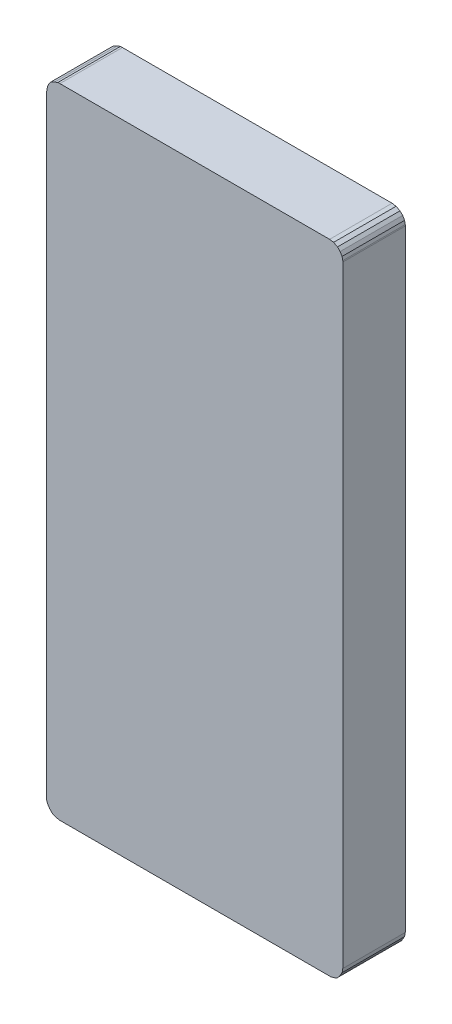
ISO-10303-21;
HEADER;
FILE_DESCRIPTION(('STEP AP214'),'2;1');
FILE_NAME('part.step','',(''),(''),'','','');
FILE_SCHEMA(('AUTOMOTIVE_DESIGN { 1 0 10303 214 1 1 1 1 }'));
ENDSEC;
DATA;
#1=APPLICATION_CONTEXT('core data for automotive mechanical design processes');
#2=APPLICATION_PROTOCOL_DEFINITION('international standard','automotive_design',2000,#1);
#3=PRODUCT_CONTEXT('',#1,'mechanical');
#4=PRODUCT('Part','Part','',(#3));
#5=PRODUCT_RELATED_PRODUCT_CATEGORY('part','',(#4));
#6=PRODUCT_DEFINITION_FORMATION('','',#4);
#7=PRODUCT_DEFINITION_CONTEXT('part definition',#1,'design');
#8=PRODUCT_DEFINITION('design','',#6,#7);
#9=PRODUCT_DEFINITION_SHAPE('','',#8);
#10=(LENGTH_UNIT() NAMED_UNIT(*) SI_UNIT(.MILLI.,.METRE.));
#11=(NAMED_UNIT(*) PLANE_ANGLE_UNIT() SI_UNIT($,.RADIAN.));
#12=(NAMED_UNIT(*) SI_UNIT($,.STERADIAN.) SOLID_ANGLE_UNIT());
#13=UNCERTAINTY_MEASURE_WITH_UNIT(LENGTH_MEASURE(1.E-05),#10,'distance_accuracy_value','');
#14=(GEOMETRIC_REPRESENTATION_CONTEXT(3) GLOBAL_UNCERTAINTY_ASSIGNED_CONTEXT((#13)) GLOBAL_UNIT_ASSIGNED_CONTEXT((#10,
#11,#12)) REPRESENTATION_CONTEXT('',''));
#15=CARTESIAN_POINT('',(0.,0.,0.));
#16=DIRECTION('',(0.,0.,1.));
#17=DIRECTION('',(1.,0.,0.));
#18=AXIS2_PLACEMENT_3D('',#15,#16,#17);
#19=CARTESIAN_POINT('',(-2.0499959,4.84999792,0.95));
#20=DIRECTION('',(0.,0.,1.));
#21=DIRECTION('',(1.,0.,0.));
#22=AXIS2_PLACEMENT_3D('',#19,#20,#21);
#23=PLANE('',#22);
#24=DIRECTION('',(-0.986433398876365,0.164161961432061,0.));
#25=VECTOR('',#24,1.);
#26=CARTESIAN_POINT('',(2.05000606,4.84998776,0.95));
#27=LINE('',#26,#25);
#28=CARTESIAN_POINT('',(2.05000606,4.84998776,0.95));
#29=VERTEX_POINT('',#28);
#30=CARTESIAN_POINT('',(2.1100034,4.84000302,0.95));
#31=VERTEX_POINT('',#30);
#32=EDGE_CURVE('E508',#29,#31,#27,.F.);
#33=ORIENTED_EDGE('',*,*,#32,.F.);
#34=DIRECTION('',(-0.99999999999693,2.47804759638983E-06,0.));
#35=VECTOR('',#34,1.);
#36=CARTESIAN_POINT('',(-2.0499959,4.84999792,0.95));
#37=LINE('',#36,#35);
#38=CARTESIAN_POINT('',(-2.04999590002709,4.84999792,0.95));
#39=VERTEX_POINT('',#38);
#40=EDGE_CURVE('E217',#39,#29,#37,.F.);
#41=ORIENTED_EDGE('',*,*,#40,.F.);
#42=DIRECTION('',(-0.999999985663054,0.000169333669372809,0.));
#43=VECTOR('',#42,1.);
#44=CARTESIAN_POINT('',(-2.07999584,4.850003,0.95));
#45=LINE('',#44,#43);
#46=CARTESIAN_POINT('',(-2.07999584,4.850003,0.95));
#47=VERTEX_POINT('',#46);
#48=EDGE_CURVE('E19',#47,#39,#45,.F.);
#49=ORIENTED_EDGE('',*,*,#48,.F.);
#50=DIRECTION('',(-0.928476690885259,-0.371390676354104,0.));
#51=VECTOR('',#50,1.);
#52=CARTESIAN_POINT('',(-2.12999574,4.83000304,0.95));
#53=LINE('',#52,#51);
#54=CARTESIAN_POINT('',(-2.12999574,4.83000304,0.95));
#55=VERTEX_POINT('',#54);
#56=EDGE_CURVE('E203',#55,#47,#53,.F.);
#57=ORIENTED_EDGE('',*,*,#56,.F.);
#58=DIRECTION('',(-0.894427190999916,-0.447213595499958,0.));
#59=VECTOR('',#58,1.);
#60=CARTESIAN_POINT('',(-2.18999562,4.8000031,0.95));
#61=LINE('',#60,#59);
#62=CARTESIAN_POINT('',(-2.18999562,4.8000031,0.95));
#63=VERTEX_POINT('',#62);
#64=EDGE_CURVE('E224',#63,#55,#61,.F.);
#65=ORIENTED_EDGE('',*,*,#64,.F.);
#66=DIRECTION('',(-0.6,-0.8,0.));
#67=VECTOR('',#66,1.);
#68=CARTESIAN_POINT('',(-2.21999556,4.76000318,0.95));
#69=LINE('',#68,#67);
#70=CARTESIAN_POINT('',(-2.21999556,4.76000318,0.95));
#71=VERTEX_POINT('',#70);
#72=EDGE_CURVE('E306',#71,#63,#69,.F.);
#73=ORIENTED_EDGE('',*,*,#72,.F.);
#74=DIRECTION('',(-0.371390676354104,-0.928476690885259,0.));
#75=VECTOR('',#74,1.);
#76=CARTESIAN_POINT('',(-2.23999552,4.71000328,0.95));
#77=LINE('',#76,#75);
#78=CARTESIAN_POINT('',(-2.23999552,4.71000328,0.95));
#79=VERTEX_POINT('',#78);
#80=EDGE_CURVE('E301',#79,#71,#77,.F.);
#81=ORIENTED_EDGE('',*,*,#80,.F.);
#82=DIRECTION('',(-0.164480243326035,-0.986380377722209,0.));
#83=VECTOR('',#82,1.);
#84=CARTESIAN_POINT('',(-2.25000058,4.6500034,0.95));
#85=LINE('',#84,#83);
#86=CARTESIAN_POINT('',(-2.25000058,4.6500034,0.95));
#87=VERTEX_POINT('',#86);
#88=EDGE_CURVE('E296',#87,#79,#85,.F.);
#89=ORIENTED_EDGE('',*,*,#88,.F.);
#90=DIRECTION('',(0.,1.,0.));
#91=VECTOR('',#90,1.);
#92=CARTESIAN_POINT('',(-2.25000058,-4.64999832,0.95));
#93=LINE('',#92,#91);
#94=CARTESIAN_POINT('',(-2.25000058,-4.64999832007946,0.950000000000001));
#95=VERTEX_POINT('',#94);
#96=EDGE_CURVE('E290',#95,#87,#93,.T.);
#97=ORIENTED_EDGE('',*,*,#96,.F.);
#98=DIRECTION('',(0.000127008318225856,-0.999999991934444,0.));
#99=VECTOR('',#98,1.);
#100=CARTESIAN_POINT('',(-2.2499955,-4.6899957,0.950000000000001));
#101=LINE('',#100,#99);
#102=CARTESIAN_POINT('',(-2.2499955,-4.6899957,0.95));
#103=VERTEX_POINT('',#102);
#104=EDGE_CURVE('E325',#103,#95,#101,.F.);
#105=ORIENTED_EDGE('',*,*,#104,.F.);
#106=DIRECTION('',(0.371390676354104,-0.928476690885259,0.));
#107=VECTOR('',#106,1.);
#108=CARTESIAN_POINT('',(-2.22999554,-4.7399956,0.95));
#109=LINE('',#108,#107);
#110=CARTESIAN_POINT('',(-2.22999554,-4.7399956,0.95));
#111=VERTEX_POINT('',#110);
#112=EDGE_CURVE('E285',#111,#103,#109,.F.);
#113=ORIENTED_EDGE('',*,*,#112,.F.);
#114=DIRECTION('',(0.6,-0.8,0.));
#115=VECTOR('',#114,1.);
#116=CARTESIAN_POINT('',(-2.1999956,-4.77999552,0.95));
#117=LINE('',#116,#115);
#118=CARTESIAN_POINT('',(-2.1999956,-4.77999552,0.95));
#119=VERTEX_POINT('',#118);
#120=EDGE_CURVE('E280',#119,#111,#117,.F.);
#121=ORIENTED_EDGE('',*,*,#120,.F.);
#122=DIRECTION('',(0.707106781186548,-0.707106781186548,0.));
#123=VECTOR('',#122,1.);
#124=CARTESIAN_POINT('',(-2.15999568,-4.81999544,0.95));
#125=LINE('',#124,#123);
#126=CARTESIAN_POINT('',(-2.15999568,-4.81999544,0.95));
#127=VERTEX_POINT('',#126);
#128=EDGE_CURVE('E275',#127,#119,#125,.F.);
#129=ORIENTED_EDGE('',*,*,#128,.F.);
#130=DIRECTION('',(0.928476690885259,-0.371390676354104,0.));
#131=VECTOR('',#130,1.);
#132=CARTESIAN_POINT('',(-2.10999578,-4.8399954,0.95));
#133=LINE('',#132,#131);
#134=CARTESIAN_POINT('',(-2.10999578,-4.83999540000001,0.95));
#135=VERTEX_POINT('',#134);
#136=EDGE_CURVE('E270',#135,#127,#133,.F.);
#137=ORIENTED_EDGE('',*,*,#136,.F.);
#138=DIRECTION('',(0.98639618128479,-0.164385442015965,0.));
#139=VECTOR('',#138,1.);
#140=CARTESIAN_POINT('',(-2.05000606,-4.84999284,0.95));
#141=LINE('',#140,#139);
#142=CARTESIAN_POINT('',(-2.05000606,-4.84999284,0.95));
#143=VERTEX_POINT('',#142);
#144=EDGE_CURVE('E265',#143,#135,#141,.F.);
#145=ORIENTED_EDGE('',*,*,#144,.F.);
#146=DIRECTION('',(0.99999999999693,-2.47804759638983E-06,0.));
#147=VECTOR('',#146,1.);
#148=CARTESIAN_POINT('',(2.0499959,-4.850003,0.95));
#149=LINE('',#148,#147);
#150=CARTESIAN_POINT('',(2.0499959,-4.850003,0.95));
#151=VERTEX_POINT('',#150);
#152=EDGE_CURVE('E260',#151,#143,#149,.F.);
#153=ORIENTED_EDGE('',*,*,#152,.F.);
#154=DIRECTION('',(0.999999927474493,0.000380855628345288,0.));
#155=VECTOR('',#154,1.);
#156=CARTESIAN_POINT('',(2.07000348,-4.84999538,0.95));
#157=LINE('',#156,#155);
#158=CARTESIAN_POINT('',(2.07000348,-4.84999537999999,0.95));
#159=VERTEX_POINT('',#158);
#160=EDGE_CURVE('E255',#159,#151,#157,.F.);
#161=ORIENTED_EDGE('',*,*,#160,.F.);
#162=DIRECTION('',(0.970142500145391,0.242535625036098,0.));
#163=VECTOR('',#162,1.);
#164=CARTESIAN_POINT('',(2.1100034,-4.8399954,0.95));
#165=LINE('',#164,#163);
#166=CARTESIAN_POINT('',(2.1100034,-4.8399954,0.95));
#167=VERTEX_POINT('',#166);
#168=EDGE_CURVE('E235',#167,#159,#165,.F.);
#169=ORIENTED_EDGE('',*,*,#168,.F.);
#170=DIRECTION('',(0.928476690885259,0.371390676354104,0.));
#171=VECTOR('',#170,1.);
#172=CARTESIAN_POINT('',(2.1600033,-4.81999544,0.95));
#173=LINE('',#172,#171);
#174=CARTESIAN_POINT('',(2.1600033,-4.81999544,0.95));
#175=VERTEX_POINT('',#174);
#176=EDGE_CURVE('E241',#175,#167,#173,.F.);
#177=ORIENTED_EDGE('',*,*,#176,.F.);
#178=DIRECTION('',(0.707106781186048,0.707106781187048,0.));
#179=VECTOR('',#178,1.);
#180=CARTESIAN_POINT('',(2.19000324,-4.7899955,0.95));
#181=LINE('',#180,#179);
#182=CARTESIAN_POINT('',(2.19000324,-4.7899955,0.95));
#183=VERTEX_POINT('',#182);
#184=EDGE_CURVE('E246',#183,#175,#181,.F.);
#185=ORIENTED_EDGE('',*,*,#184,.F.);
#186=DIRECTION('',(0.554700196224998,0.832050294337997,0.));
#187=VECTOR('',#186,1.);
#188=CARTESIAN_POINT('',(2.2100032,-4.75999556,0.95));
#189=LINE('',#188,#187);
#190=CARTESIAN_POINT('',(2.21000320000001,-4.75999556,0.95));
#191=VERTEX_POINT('',#190);
#192=EDGE_CURVE('E252',#191,#183,#189,.F.);
#193=ORIENTED_EDGE('',*,*,#192,.F.);
#194=DIRECTION('',(0.514495755426938,0.857492925712897,0.));
#195=VECTOR('',#194,1.);
#196=CARTESIAN_POINT('',(2.24000314,-4.70999566,0.95));
#197=LINE('',#196,#195);
#198=CARTESIAN_POINT('',(2.24000314,-4.70999566,0.95));
#199=VERTEX_POINT('',#198);
#200=EDGE_CURVE('E476',#199,#191,#197,.F.);
#201=ORIENTED_EDGE('',*,*,#200,.F.);
#202=DIRECTION('',(0.164229657338,0.986422130556002,0.));
#203=VECTOR('',#202,1.);
#204=CARTESIAN_POINT('',(2.24999042,-4.65000848,0.95));
#205=LINE('',#204,#203);
#206=CARTESIAN_POINT('',(2.24999042,-4.65000848,0.95));
#207=VERTEX_POINT('',#206);
#208=EDGE_CURVE('E480',#207,#199,#205,.F.);
#209=ORIENTED_EDGE('',*,*,#208,.F.);
#210=DIRECTION('',(1.09247291646744E-06,0.999999999999403,0.));
#211=VECTOR('',#210,1.);
#212=CARTESIAN_POINT('',(2.25000058,4.64999324,0.95));
#213=LINE('',#212,#211);
#214=CARTESIAN_POINT('',(2.25000058,4.64999324,0.95));
#215=VERTEX_POINT('',#214);
#216=EDGE_CURVE('E484',#215,#207,#213,.F.);
#217=ORIENTED_EDGE('',*,*,#216,.F.);
#218=DIRECTION('',(0.000126935769327356,0.999999991943655,0.));
#219=VECTOR('',#218,1.);
#220=CARTESIAN_POINT('',(2.25000312,4.67000336,0.95));
#221=LINE('',#220,#219);
#222=CARTESIAN_POINT('',(2.25000312,4.67000336,0.95));
#223=VERTEX_POINT('',#222);
#224=EDGE_CURVE('E488',#223,#215,#221,.F.);
#225=ORIENTED_EDGE('',*,*,#224,.F.);
#226=DIRECTION('',(-0.196116135137992,0.980580675690959,0.));
#227=VECTOR('',#226,1.);
#228=CARTESIAN_POINT('',(2.24000314,4.72000326,0.95));
#229=LINE('',#228,#227);
#230=CARTESIAN_POINT('',(2.24000313999999,4.72000326,0.95));
#231=VERTEX_POINT('',#230);
#232=EDGE_CURVE('E492',#231,#223,#229,.F.);
#233=ORIENTED_EDGE('',*,*,#232,.F.);
#234=DIRECTION('',(-0.514495755426938,0.857492925712897,0.));
#235=VECTOR('',#234,1.);
#236=CARTESIAN_POINT('',(2.2100032,4.77000316,0.95));
#237=LINE('',#236,#235);
#238=CARTESIAN_POINT('',(2.2100032,4.77000316,0.95));
#239=VERTEX_POINT('',#238);
#240=EDGE_CURVE('E496',#239,#231,#237,.F.);
#241=ORIENTED_EDGE('',*,*,#240,.F.);
#242=DIRECTION('',(-0.707106781186548,0.707106781186548,0.));
#243=VECTOR('',#242,1.);
#244=CARTESIAN_POINT('',(2.17000328,4.81000308,0.95));
#245=LINE('',#244,#243);
#246=CARTESIAN_POINT('',(2.17000328,4.81000308,0.95));
#247=VERTEX_POINT('',#246);
#248=EDGE_CURVE('E500',#247,#239,#245,.F.);
#249=ORIENTED_EDGE('',*,*,#248,.F.);
#250=DIRECTION('',(-0.894427190999916,0.447213595499958,0.));
#251=VECTOR('',#250,1.);
#252=CARTESIAN_POINT('',(2.1100034,4.84000302,0.95));
#253=LINE('',#252,#251);
#254=EDGE_CURVE('E504',#31,#247,#253,.F.);
#255=ORIENTED_EDGE('',*,*,#254,.F.);
#256=EDGE_LOOP('',(#33,#41,#49,#57,#65,#73,#81,#89,#97,#105,#113,#121,#129,#137,#145,#153,#161,
#169,#177,#185,#193,#201,#209,#217,#225,#233,#241,#249,#255));
#257=FACE_BOUND('',#256,.T.);
#258=ADVANCED_FACE('F16',(#257),#23,.T.);
#259=CARTESIAN_POINT('',(-2.07999584,4.850003,0.));
#260=DIRECTION('',(0.000169333669372809,0.999999985663054,0.));
#261=DIRECTION('',(-0.999999985663054,0.000169333669372809,0.));
#262=AXIS2_PLACEMENT_3D('',#259,#260,#261);
#263=PLANE('',#262);
#264=DIRECTION('',(0.,0.,1.));
#265=VECTOR('',#264,1.);
#266=CARTESIAN_POINT('',(-2.0499959,4.84999792,0.));
#267=LINE('',#266,#265);
#268=CARTESIAN_POINT('',(-2.04999588049491,4.84999791999833,0.));
#269=VERTEX_POINT('',#268);
#270=EDGE_CURVE('E231',#269,#39,#267,.T.);
#271=ORIENTED_EDGE('',*,*,#270,.F.);
#272=DIRECTION('',(-0.999999985663054,0.000169333669372809,0.));
#273=VECTOR('',#272,1.);
#274=CARTESIAN_POINT('',(-2.07999584,4.850003,0.));
#275=LINE('',#274,#273);
#276=CARTESIAN_POINT('',(-2.07999584,4.850003,0.));
#277=VERTEX_POINT('',#276);
#278=EDGE_CURVE('E223',#269,#277,#275,.T.);
#279=ORIENTED_EDGE('',*,*,#278,.T.);
#280=DIRECTION('',(0.,0.,1.));
#281=VECTOR('',#280,1.);
#282=CARTESIAN_POINT('',(-2.07999584,4.850003,0.));
#283=LINE('',#282,#281);
#284=EDGE_CURVE('E208',#47,#277,#283,.F.);
#285=ORIENTED_EDGE('',*,*,#284,.F.);
#286=ORIENTED_EDGE('',*,*,#48,.T.);
#287=EDGE_LOOP('',(#271,#279,#285,#286));
#288=FACE_BOUND('',#287,.T.);
#289=ADVANCED_FACE('F222',(#288),#263,.T.);
#290=CARTESIAN_POINT('',(-2.12999574,4.83000304,0.));
#291=DIRECTION('',(-0.371390676354104,0.928476690885259,0.));
#292=DIRECTION('',(-0.928476690885259,-0.371390676354104,0.));
#293=AXIS2_PLACEMENT_3D('',#290,#291,#292);
#294=PLANE('',#293);
#295=ORIENTED_EDGE('',*,*,#284,.T.);
#296=DIRECTION('',(-0.928476690885258,-0.371390676354106,0.));
#297=VECTOR('',#296,1.);
#298=CARTESIAN_POINT('',(-2.07999584,4.850003,0.));
#299=LINE('',#298,#297);
#300=CARTESIAN_POINT('',(-2.12999574,4.83000304,0.));
#301=VERTEX_POINT('',#300);
#302=EDGE_CURVE('E324',#277,#301,#299,.T.);
#303=ORIENTED_EDGE('',*,*,#302,.T.);
#304=DIRECTION('',(0.,0.,1.));
#305=VECTOR('',#304,1.);
#306=CARTESIAN_POINT('',(-2.12999574,4.83000304,0.));
#307=LINE('',#306,#305);
#308=EDGE_CURVE('E210',#55,#301,#307,.F.);
#309=ORIENTED_EDGE('',*,*,#308,.F.);
#310=ORIENTED_EDGE('',*,*,#56,.T.);
#311=EDGE_LOOP('',(#295,#303,#309,#310));
#312=FACE_BOUND('',#311,.T.);
#313=ADVANCED_FACE('F205',(#312),#294,.T.);
#314=CARTESIAN_POINT('',(-2.18999562,4.8000031,0.));
#315=DIRECTION('',(-0.447213595499958,0.894427190999916,0.));
#316=DIRECTION('',(-0.894427190999916,-0.447213595499958,0.));
#317=AXIS2_PLACEMENT_3D('',#314,#315,#316);
#318=PLANE('',#317);
#319=ORIENTED_EDGE('',*,*,#308,.T.);
#320=DIRECTION('',(-0.894427190999911,-0.447213595499968,0.));
#321=VECTOR('',#320,1.);
#322=CARTESIAN_POINT('',(-2.12999574,4.83000304,0.));
#323=LINE('',#322,#321);
#324=CARTESIAN_POINT('',(-2.18999562,4.8000031,0.));
#325=VERTEX_POINT('',#324);
#326=EDGE_CURVE('E359',#301,#325,#323,.T.);
#327=ORIENTED_EDGE('',*,*,#326,.T.);
#328=DIRECTION('',(0.,0.,1.));
#329=VECTOR('',#328,1.);
#330=CARTESIAN_POINT('',(-2.18999562,4.8000031,0.));
#331=LINE('',#330,#329);
#332=EDGE_CURVE('E303',#63,#325,#331,.F.);
#333=ORIENTED_EDGE('',*,*,#332,.F.);
#334=ORIENTED_EDGE('',*,*,#64,.T.);
#335=EDGE_LOOP('',(#319,#327,#333,#334));
#336=FACE_BOUND('',#335,.T.);
#337=ADVANCED_FACE('F379',(#336),#318,.T.);
#338=CARTESIAN_POINT('',(-2.21999556,4.76000318,0.));
#339=DIRECTION('',(-0.8,0.6,0.));
#340=DIRECTION('',(-0.6,-0.8,0.));
#341=AXIS2_PLACEMENT_3D('',#338,#339,#340);
#342=PLANE('',#341);
#343=ORIENTED_EDGE('',*,*,#332,.T.);
#344=DIRECTION('',(-0.600000000000008,-0.799999999999994,0.));
#345=VECTOR('',#344,1.);
#346=CARTESIAN_POINT('',(-2.18999562,4.8000031,0.));
#347=LINE('',#346,#345);
#348=CARTESIAN_POINT('',(-2.21999556,4.76000318,0.));
#349=VERTEX_POINT('',#348);
#350=EDGE_CURVE('E351',#325,#349,#347,.T.);
#351=ORIENTED_EDGE('',*,*,#350,.T.);
#352=DIRECTION('',(0.,0.,1.));
#353=VECTOR('',#352,1.);
#354=CARTESIAN_POINT('',(-2.21999556,4.76000318,0.));
#355=LINE('',#354,#353);
#356=EDGE_CURVE('E298',#71,#349,#355,.F.);
#357=ORIENTED_EDGE('',*,*,#356,.F.);
#358=ORIENTED_EDGE('',*,*,#72,.T.);
#359=EDGE_LOOP('',(#343,#351,#357,#358));
#360=FACE_BOUND('',#359,.T.);
#361=ADVANCED_FACE('F386',(#360),#342,.T.);
#362=CARTESIAN_POINT('',(-2.23999552,4.71000328,0.));
#363=DIRECTION('',(-0.928476690885259,0.371390676354104,0.));
#364=DIRECTION('',(-0.371390676354104,-0.928476690885259,0.));
#365=AXIS2_PLACEMENT_3D('',#362,#363,#364);
#366=PLANE('',#365);
#367=ORIENTED_EDGE('',*,*,#356,.T.);
#368=DIRECTION('',(-0.3713906763541,-0.928476690885261,0.));
#369=VECTOR('',#368,1.);
#370=CARTESIAN_POINT('',(-2.21999556,4.76000318,0.));
#371=LINE('',#370,#369);
#372=CARTESIAN_POINT('',(-2.23999552,4.71000328,0.));
#373=VERTEX_POINT('',#372);
#374=EDGE_CURVE('E343',#349,#373,#371,.T.);
#375=ORIENTED_EDGE('',*,*,#374,.T.);
#376=DIRECTION('',(0.,0.,1.));
#377=VECTOR('',#376,1.);
#378=CARTESIAN_POINT('',(-2.23999552,4.71000328,0.));
#379=LINE('',#378,#377);
#380=EDGE_CURVE('E293',#79,#373,#379,.F.);
#381=ORIENTED_EDGE('',*,*,#380,.F.);
#382=ORIENTED_EDGE('',*,*,#80,.T.);
#383=EDGE_LOOP('',(#367,#375,#381,#382));
#384=FACE_BOUND('',#383,.T.);
#385=ADVANCED_FACE('F388',(#384),#366,.T.);
#386=CARTESIAN_POINT('',(-2.25000058,4.6500034,0.));
#387=DIRECTION('',(-0.986380377722209,0.164480243326035,0.));
#388=DIRECTION('',(-0.164480243326035,-0.986380377722209,0.));
#389=AXIS2_PLACEMENT_3D('',#386,#387,#388);
#390=PLANE('',#389);
#391=ORIENTED_EDGE('',*,*,#380,.T.);
#392=DIRECTION('',(-0.164480243326046,-0.986380377722207,0.));
#393=VECTOR('',#392,1.);
#394=CARTESIAN_POINT('',(-2.23999552,4.71000328,0.));
#395=LINE('',#394,#393);
#396=CARTESIAN_POINT('',(-2.25000058,4.6500034,0.));
#397=VERTEX_POINT('',#396);
#398=EDGE_CURVE('E340',#373,#397,#395,.T.);
#399=ORIENTED_EDGE('',*,*,#398,.T.);
#400=DIRECTION('',(0.,0.,1.));
#401=VECTOR('',#400,1.);
#402=CARTESIAN_POINT('',(-2.25000058,4.6500034,0.));
#403=LINE('',#402,#401);
#404=EDGE_CURVE('E292',#87,#397,#403,.F.);
#405=ORIENTED_EDGE('',*,*,#404,.F.);
#406=ORIENTED_EDGE('',*,*,#88,.T.);
#407=EDGE_LOOP('',(#391,#399,#405,#406));
#408=FACE_BOUND('',#407,.T.);
#409=ADVANCED_FACE('F392',(#408),#390,.T.);
#410=CARTESIAN_POINT('',(-2.25000058,-4.64999832,0.));
#411=DIRECTION('',(-1.,0.,0.));
#412=DIRECTION('',(0.,0.,1.));
#413=AXIS2_PLACEMENT_3D('',#410,#411,#412);
#414=PLANE('',#413);
#415=ORIENTED_EDGE('',*,*,#404,.T.);
#416=DIRECTION('',(0.,1.,0.));
#417=VECTOR('',#416,1.);
#418=CARTESIAN_POINT('',(-2.25000058,4.84999792,0.));
#419=LINE('',#418,#417);
#420=CARTESIAN_POINT('',(-2.25000058000076,-4.64999830810735,0.));
#421=VERTEX_POINT('',#420);
#422=EDGE_CURVE('E323',#397,#421,#419,.F.);
#423=ORIENTED_EDGE('',*,*,#422,.T.);
#424=DIRECTION('',(0.,0.,1.));
#425=VECTOR('',#424,1.);
#426=CARTESIAN_POINT('',(-2.25000058000001,-4.64999832,0.));
#427=LINE('',#426,#425);
#428=EDGE_CURVE('E287',#95,#421,#427,.F.);
#429=ORIENTED_EDGE('',*,*,#428,.F.);
#430=ORIENTED_EDGE('',*,*,#96,.T.);
#431=EDGE_LOOP('',(#415,#423,#429,#430));
#432=FACE_BOUND('',#431,.T.);
#433=ADVANCED_FACE('F395',(#432),#414,.T.);
#434=CARTESIAN_POINT('',(-2.2499955,-4.6899957,0.));
#435=DIRECTION('',(-0.999999991934444,-0.000127008318225856,0.));
#436=DIRECTION('',(0.000127008318225856,-0.999999991934444,0.));
#437=AXIS2_PLACEMENT_3D('',#434,#435,#436);
#438=PLANE('',#437);
#439=ORIENTED_EDGE('',*,*,#428,.T.);
#440=DIRECTION('',(0.000127008318225856,-0.999999991934444,0.));
#441=VECTOR('',#440,1.);
#442=CARTESIAN_POINT('',(-2.2499955,-4.6899957,0.));
#443=LINE('',#442,#441);
#444=CARTESIAN_POINT('',(-2.2499955,-4.6899957,0.));
#445=VERTEX_POINT('',#444);
#446=EDGE_CURVE('E319',#421,#445,#443,.T.);
#447=ORIENTED_EDGE('',*,*,#446,.T.);
#448=DIRECTION('',(0.,0.,1.));
#449=VECTOR('',#448,1.);
#450=CARTESIAN_POINT('',(-2.2499955,-4.6899957,0.));
#451=LINE('',#450,#449);
#452=EDGE_CURVE('E282',#103,#445,#451,.F.);
#453=ORIENTED_EDGE('',*,*,#452,.F.);
#454=ORIENTED_EDGE('',*,*,#104,.T.);
#455=EDGE_LOOP('',(#439,#447,#453,#454));
#456=FACE_BOUND('',#455,.T.);
#457=ADVANCED_FACE('F396',(#456),#438,.T.);
#458=CARTESIAN_POINT('',(-2.22999554,-4.7399956,0.));
#459=DIRECTION('',(-0.928476690885259,-0.371390676354104,0.));
#460=DIRECTION('',(0.371390676354104,-0.928476690885259,0.));
#461=AXIS2_PLACEMENT_3D('',#458,#459,#460);
#462=PLANE('',#461);
#463=ORIENTED_EDGE('',*,*,#452,.T.);
#464=DIRECTION('',(0.3713906763541,-0.928476690885261,0.));
#465=VECTOR('',#464,1.);
#466=CARTESIAN_POINT('',(-2.2499955,-4.6899957,0.));
#467=LINE('',#466,#465);
#468=CARTESIAN_POINT('',(-2.22999554,-4.7399956,0.));
#469=VERTEX_POINT('',#468);
#470=EDGE_CURVE('E322',#445,#469,#467,.T.);
#471=ORIENTED_EDGE('',*,*,#470,.T.);
#472=DIRECTION('',(0.,0.,1.));
#473=VECTOR('',#472,1.);
#474=CARTESIAN_POINT('',(-2.22999554,-4.7399956,0.));
#475=LINE('',#474,#473);
#476=EDGE_CURVE('E277',#111,#469,#475,.F.);
#477=ORIENTED_EDGE('',*,*,#476,.F.);
#478=ORIENTED_EDGE('',*,*,#112,.T.);
#479=EDGE_LOOP('',(#463,#471,#477,#478));
#480=FACE_BOUND('',#479,.T.);
#481=ADVANCED_FACE('F416',(#480),#462,.T.);
#482=CARTESIAN_POINT('',(-2.1999956,-4.77999552,0.));
#483=DIRECTION('',(-0.8,-0.6,0.));
#484=DIRECTION('',(0.6,-0.8,0.));
#485=AXIS2_PLACEMENT_3D('',#482,#483,#484);
#486=PLANE('',#485);
#487=ORIENTED_EDGE('',*,*,#476,.T.);
#488=DIRECTION('',(0.6,-0.8,0.));
#489=VECTOR('',#488,1.);
#490=CARTESIAN_POINT('',(-2.22999554,-4.7399956,0.));
#491=LINE('',#490,#489);
#492=CARTESIAN_POINT('',(-2.1999956,-4.77999552,0.));
#493=VERTEX_POINT('',#492);
#494=EDGE_CURVE('E402',#469,#493,#491,.T.);
#495=ORIENTED_EDGE('',*,*,#494,.T.);
#496=DIRECTION('',(0.,0.,1.));
#497=VECTOR('',#496,1.);
#498=CARTESIAN_POINT('',(-2.1999956,-4.77999552,0.));
#499=LINE('',#498,#497);
#500=EDGE_CURVE('E272',#119,#493,#499,.F.);
#501=ORIENTED_EDGE('',*,*,#500,.F.);
#502=ORIENTED_EDGE('',*,*,#120,.T.);
#503=EDGE_LOOP('',(#487,#495,#501,#502));
#504=FACE_BOUND('',#503,.T.);
#505=ADVANCED_FACE('F423',(#504),#486,.T.);
#506=CARTESIAN_POINT('',(-2.15999568,-4.81999544,0.));
#507=DIRECTION('',(-0.707106781186548,-0.707106781186548,0.));
#508=DIRECTION('',(0.707106781186548,-0.707106781186548,0.));
#509=AXIS2_PLACEMENT_3D('',#506,#507,#508);
#510=PLANE('',#509);
#511=ORIENTED_EDGE('',*,*,#500,.T.);
#512=DIRECTION('',(0.70710678118654,-0.707106781186555,0.));
#513=VECTOR('',#512,1.);
#514=CARTESIAN_POINT('',(-2.1999956,-4.77999552,0.));
#515=LINE('',#514,#513);
#516=CARTESIAN_POINT('',(-2.15999568,-4.81999544,0.));
#517=VERTEX_POINT('',#516);
#518=EDGE_CURVE('E406',#493,#517,#515,.T.);
#519=ORIENTED_EDGE('',*,*,#518,.T.);
#520=DIRECTION('',(0.,0.,1.));
#521=VECTOR('',#520,1.);
#522=CARTESIAN_POINT('',(-2.15999568,-4.81999544,0.));
#523=LINE('',#522,#521);
#524=EDGE_CURVE('E267',#127,#517,#523,.F.);
#525=ORIENTED_EDGE('',*,*,#524,.F.);
#526=ORIENTED_EDGE('',*,*,#128,.T.);
#527=EDGE_LOOP('',(#511,#519,#525,#526));
#528=FACE_BOUND('',#527,.T.);
#529=ADVANCED_FACE('F627',(#528),#510,.T.);
#530=CARTESIAN_POINT('',(-2.10999578,-4.8399954,0.));
#531=DIRECTION('',(-0.371390676354104,-0.928476690885259,0.));
#532=DIRECTION('',(0.928476690885259,-0.371390676354104,0.));
#533=AXIS2_PLACEMENT_3D('',#530,#531,#532);
#534=PLANE('',#533);
#535=ORIENTED_EDGE('',*,*,#524,.T.);
#536=DIRECTION('',(0.928476690885264,-0.371390676354093,0.));
#537=VECTOR('',#536,1.);
#538=CARTESIAN_POINT('',(-2.15999568,-4.81999544,0.));
#539=LINE('',#538,#537);
#540=CARTESIAN_POINT('',(-2.10999578,-4.8399954,0.));
#541=VERTEX_POINT('',#540);
#542=EDGE_CURVE('E435',#517,#541,#539,.T.);
#543=ORIENTED_EDGE('',*,*,#542,.T.);
#544=DIRECTION('',(0.,0.,1.));
#545=VECTOR('',#544,1.);
#546=CARTESIAN_POINT('',(-2.10999578,-4.83999540000001,0.));
#547=LINE('',#546,#545);
#548=EDGE_CURVE('E262',#135,#541,#547,.F.);
#549=ORIENTED_EDGE('',*,*,#548,.F.);
#550=ORIENTED_EDGE('',*,*,#136,.T.);
#551=EDGE_LOOP('',(#535,#543,#549,#550));
#552=FACE_BOUND('',#551,.T.);
#553=ADVANCED_FACE('F626',(#552),#534,.T.);
#554=CARTESIAN_POINT('',(-2.05000606,-4.84999284,0.));
#555=DIRECTION('',(-0.164385442015965,-0.98639618128479,0.));
#556=DIRECTION('',(0.98639618128479,-0.164385442015965,0.));
#557=AXIS2_PLACEMENT_3D('',#554,#555,#556);
#558=PLANE('',#557);
#559=ORIENTED_EDGE('',*,*,#548,.T.);
#560=DIRECTION('',(0.986396181284765,-0.164385442016114,0.));
#561=VECTOR('',#560,1.);
#562=CARTESIAN_POINT('',(-2.10999578,-4.8399954,0.));
#563=LINE('',#562,#561);
#564=CARTESIAN_POINT('',(-2.05000606,-4.84999284,0.));
#565=VERTEX_POINT('',#564);
#566=EDGE_CURVE('E443',#541,#565,#563,.T.);
#567=ORIENTED_EDGE('',*,*,#566,.T.);
#568=DIRECTION('',(0.,0.,1.));
#569=VECTOR('',#568,1.);
#570=CARTESIAN_POINT('',(-2.05000606,-4.84999284,0.));
#571=LINE('',#570,#569);
#572=EDGE_CURVE('E257',#143,#565,#571,.F.);
#573=ORIENTED_EDGE('',*,*,#572,.F.);
#574=ORIENTED_EDGE('',*,*,#144,.T.);
#575=EDGE_LOOP('',(#559,#567,#573,#574));
#576=FACE_BOUND('',#575,.T.);
#577=ADVANCED_FACE('F623',(#576),#558,.T.);
#578=CARTESIAN_POINT('',(2.0499959,-4.850003,0.));
#579=DIRECTION('',(-2.47804759638983E-06,-0.99999999999693,0.));
#580=DIRECTION('',(0.99999999999693,-2.47804759638983E-06,0.));
#581=AXIS2_PLACEMENT_3D('',#578,#579,#580);
#582=PLANE('',#581);
#583=ORIENTED_EDGE('',*,*,#572,.T.);
#584=DIRECTION('',(0.999999999996929,-2.47804759610525E-06,0.));
#585=VECTOR('',#584,1.);
#586=CARTESIAN_POINT('',(-2.05000606,-4.84999284,0.));
#587=LINE('',#586,#585);
#588=CARTESIAN_POINT('',(2.0499958931236,-4.8500030000013,0.));
#589=VERTEX_POINT('',#588);
#590=EDGE_CURVE('E318',#565,#589,#587,.T.);
#591=ORIENTED_EDGE('',*,*,#590,.T.);
#592=DIRECTION('',(0.,0.,1.));
#593=VECTOR('',#592,1.);
#594=CARTESIAN_POINT('',(2.0499959,-4.85000300000001,0.));
#595=LINE('',#594,#593);
#596=EDGE_CURVE('E238',#151,#589,#595,.F.);
#597=ORIENTED_EDGE('',*,*,#596,.F.);
#598=ORIENTED_EDGE('',*,*,#152,.T.);
#599=EDGE_LOOP('',(#583,#591,#597,#598));
#600=FACE_BOUND('',#599,.T.);
#601=ADVANCED_FACE('F617',(#600),#582,.T.);
#602=CARTESIAN_POINT('',(2.07000348,-4.84999538,0.));
#603=DIRECTION('',(0.000380855628345288,-0.999999927474493,0.));
#604=DIRECTION('',(0.999999927474493,0.000380855628345288,0.));
#605=AXIS2_PLACEMENT_3D('',#602,#603,#604);
#606=PLANE('',#605);
#607=ORIENTED_EDGE('',*,*,#596,.T.);
#608=DIRECTION('',(0.999999927474493,0.000380855628345288,0.));
#609=VECTOR('',#608,1.);
#610=CARTESIAN_POINT('',(2.07000348,-4.84999538,0.));
#611=LINE('',#610,#609);
#612=CARTESIAN_POINT('',(2.07000348,-4.84999538,0.));
#613=VERTEX_POINT('',#612);
#614=EDGE_CURVE('E314',#589,#613,#611,.T.);
#615=ORIENTED_EDGE('',*,*,#614,.T.);
#616=DIRECTION('',(0.,0.,1.));
#617=VECTOR('',#616,1.);
#618=CARTESIAN_POINT('',(2.07000348,-4.84999537999999,0.));
#619=LINE('',#618,#617);
#620=EDGE_CURVE('E237',#159,#613,#619,.F.);
#621=ORIENTED_EDGE('',*,*,#620,.F.);
#622=ORIENTED_EDGE('',*,*,#160,.T.);
#623=EDGE_LOOP('',(#607,#615,#621,#622));
#624=FACE_BOUND('',#623,.T.);
#625=ADVANCED_FACE('F613',(#624),#606,.T.);
#626=CARTESIAN_POINT('',(2.1100034,-4.8399954,0.));
#627=DIRECTION('',(0.242535625036098,-0.970142500145391,0.));
#628=DIRECTION('',(0.970142500145391,0.242535625036098,0.));
#629=AXIS2_PLACEMENT_3D('',#626,#627,#628);
#630=PLANE('',#629);
#631=ORIENTED_EDGE('',*,*,#620,.T.);
#632=DIRECTION('',(0.970142500145323,0.242535625036368,0.));
#633=VECTOR('',#632,1.);
#634=CARTESIAN_POINT('',(2.07000348,-4.84999538,0.));
#635=LINE('',#634,#633);
#636=CARTESIAN_POINT('',(2.1100034,-4.8399954,0.));
#637=VERTEX_POINT('',#636);
#638=EDGE_CURVE('E317',#613,#637,#635,.T.);
#639=ORIENTED_EDGE('',*,*,#638,.T.);
#640=DIRECTION('',(0.,0.,1.));
#641=VECTOR('',#640,1.);
#642=CARTESIAN_POINT('',(2.1100034,-4.8399954,0.));
#643=LINE('',#642,#641);
#644=EDGE_CURVE('E243',#167,#637,#643,.F.);
#645=ORIENTED_EDGE('',*,*,#644,.F.);
#646=ORIENTED_EDGE('',*,*,#168,.T.);
#647=EDGE_LOOP('',(#631,#639,#645,#646));
#648=FACE_BOUND('',#647,.T.);
#649=ADVANCED_FACE('F607',(#648),#630,.T.);
#650=CARTESIAN_POINT('',(2.1600033,-4.81999544,0.));
#651=DIRECTION('',(0.371390676354104,-0.928476690885259,0.));
#652=DIRECTION('',(0.928476690885259,0.371390676354104,0.));
#653=AXIS2_PLACEMENT_3D('',#650,#651,#652);
#654=PLANE('',#653);
#655=ORIENTED_EDGE('',*,*,#644,.T.);
#656=DIRECTION('',(0.928476690885264,0.371390676354093,0.));
#657=VECTOR('',#656,1.);
#658=CARTESIAN_POINT('',(2.1100034,-4.8399954,0.));
#659=LINE('',#658,#657);
#660=CARTESIAN_POINT('',(2.16000330000001,-4.81999544000001,0.));
#661=VERTEX_POINT('',#660);
#662=EDGE_CURVE('E466',#637,#661,#659,.T.);
#663=ORIENTED_EDGE('',*,*,#662,.T.);
#664=DIRECTION('',(0.,0.,1.));
#665=VECTOR('',#664,1.);
#666=CARTESIAN_POINT('',(2.16000330000002,-4.81999544000002,0.));
#667=LINE('',#666,#665);
#668=EDGE_CURVE('E248',#175,#661,#667,.F.);
#669=ORIENTED_EDGE('',*,*,#668,.F.);
#670=ORIENTED_EDGE('',*,*,#176,.T.);
#671=EDGE_LOOP('',(#655,#663,#669,#670));
#672=FACE_BOUND('',#671,.T.);
#673=ADVANCED_FACE('F603',(#672),#654,.T.);
#674=CARTESIAN_POINT('',(2.19000324,-4.7899955,0.));
#675=DIRECTION('',(0.707106781187048,-0.707106781186048,0.));
#676=DIRECTION('',(0.707106781186048,0.707106781187048,0.));
#677=AXIS2_PLACEMENT_3D('',#674,#675,#676);
#678=PLANE('',#677);
#679=ORIENTED_EDGE('',*,*,#668,.T.);
#680=DIRECTION('',(0.707106781186537,0.707106781186558,0.));
#681=VECTOR('',#680,1.);
#682=CARTESIAN_POINT('',(2.1600033,-4.81999544,0.));
#683=LINE('',#682,#681);
#684=CARTESIAN_POINT('',(2.19000324,-4.7899955,0.));
#685=VERTEX_POINT('',#684);
#686=EDGE_CURVE('E469',#661,#685,#683,.T.);
#687=ORIENTED_EDGE('',*,*,#686,.T.);
#688=DIRECTION('',(0.,0.,1.));
#689=VECTOR('',#688,1.);
#690=CARTESIAN_POINT('',(2.19000324000001,-4.78999550000001,0.));
#691=LINE('',#690,#689);
#692=EDGE_CURVE('E474',#183,#685,#691,.F.);
#693=ORIENTED_EDGE('',*,*,#692,.F.);
#694=ORIENTED_EDGE('',*,*,#184,.T.);
#695=EDGE_LOOP('',(#679,#687,#693,#694));
#696=FACE_BOUND('',#695,.T.);
#697=ADVANCED_FACE('F597',(#696),#678,.T.);
#698=CARTESIAN_POINT('',(2.2100032,-4.75999556,0.));
#699=DIRECTION('',(0.832050294337997,-0.554700196224998,0.));
#700=DIRECTION('',(0.554700196224998,0.832050294337997,0.));
#701=AXIS2_PLACEMENT_3D('',#698,#699,#700);
#702=PLANE('',#701);
#703=ORIENTED_EDGE('',*,*,#692,.T.);
#704=DIRECTION('',(0.554700196225224,0.832050294337847,0.));
#705=VECTOR('',#704,1.);
#706=CARTESIAN_POINT('',(2.19000324,-4.7899955,0.));
#707=LINE('',#706,#705);
#708=CARTESIAN_POINT('',(2.21000320000001,-4.75999556,0.));
#709=VERTEX_POINT('',#708);
#710=EDGE_CURVE('E518',#685,#709,#707,.T.);
#711=ORIENTED_EDGE('',*,*,#710,.T.);
#712=DIRECTION('',(0.,0.,1.));
#713=VECTOR('',#712,1.);
#714=CARTESIAN_POINT('',(2.21000320000003,-4.75999556000002,0.));
#715=LINE('',#714,#713);
#716=EDGE_CURVE('E478',#191,#709,#715,.F.);
#717=ORIENTED_EDGE('',*,*,#716,.F.);
#718=ORIENTED_EDGE('',*,*,#192,.T.);
#719=EDGE_LOOP('',(#703,#711,#717,#718));
#720=FACE_BOUND('',#719,.T.);
#721=ADVANCED_FACE('F593',(#720),#702,.T.);
#722=CARTESIAN_POINT('',(2.24000314,-4.70999566,0.));
#723=DIRECTION('',(0.857492925712897,-0.514495755426938,0.));
#724=DIRECTION('',(0.514495755426938,0.857492925712897,0.));
#725=AXIS2_PLACEMENT_3D('',#722,#723,#724);
#726=PLANE('',#725);
#727=ORIENTED_EDGE('',*,*,#716,.T.);
#728=DIRECTION('',(0.514495755427524,0.857492925712546,0.));
#729=VECTOR('',#728,1.);
#730=CARTESIAN_POINT('',(2.2100032,-4.75999556,0.));
#731=LINE('',#730,#729);
#732=CARTESIAN_POINT('',(2.24000314,-4.70999566,0.));
#733=VERTEX_POINT('',#732);
#734=EDGE_CURVE('E521',#709,#733,#731,.T.);
#735=ORIENTED_EDGE('',*,*,#734,.T.);
#736=DIRECTION('',(0.,0.,1.));
#737=VECTOR('',#736,1.);
#738=CARTESIAN_POINT('',(2.24000313999999,-4.70999566,0.));
#739=LINE('',#738,#737);
#740=EDGE_CURVE('E482',#199,#733,#739,.F.);
#741=ORIENTED_EDGE('',*,*,#740,.F.);
#742=ORIENTED_EDGE('',*,*,#200,.T.);
#743=EDGE_LOOP('',(#727,#735,#741,#742));
#744=FACE_BOUND('',#743,.T.);
#745=ADVANCED_FACE('F587',(#744),#726,.T.);
#746=CARTESIAN_POINT('',(2.24999042,-4.65000848,0.));
#747=DIRECTION('',(0.986422130556002,-0.164229657338,0.));
#748=DIRECTION('',(0.164229657338,0.986422130556002,0.));
#749=AXIS2_PLACEMENT_3D('',#746,#747,#748);
#750=PLANE('',#749);
#751=ORIENTED_EDGE('',*,*,#740,.T.);
#752=DIRECTION('',(0.164229657337786,0.986422130556038,0.));
#753=VECTOR('',#752,1.);
#754=CARTESIAN_POINT('',(2.24000314,-4.70999566,0.));
#755=LINE('',#754,#753);
#756=CARTESIAN_POINT('',(2.24999042,-4.65000848,0.));
#757=VERTEX_POINT('',#756);
#758=EDGE_CURVE('E524',#733,#757,#755,.T.);
#759=ORIENTED_EDGE('',*,*,#758,.T.);
#760=DIRECTION('',(0.,0.,1.));
#761=VECTOR('',#760,1.);
#762=CARTESIAN_POINT('',(2.24999042,-4.65000848,0.));
#763=LINE('',#762,#761);
#764=EDGE_CURVE('E486',#207,#757,#763,.F.);
#765=ORIENTED_EDGE('',*,*,#764,.F.);
#766=ORIENTED_EDGE('',*,*,#208,.T.);
#767=EDGE_LOOP('',(#751,#759,#765,#766));
#768=FACE_BOUND('',#767,.T.);
#769=ADVANCED_FACE('F583',(#768),#750,.T.);
#770=CARTESIAN_POINT('',(2.25000058,4.64999324,0.));
#771=DIRECTION('',(0.999999999999403,-1.09247291646744E-06,0.));
#772=DIRECTION('',(1.09247291646744E-06,0.999999999999403,0.));
#773=AXIS2_PLACEMENT_3D('',#770,#771,#772);
#774=PLANE('',#773);
#775=ORIENTED_EDGE('',*,*,#764,.T.);
#776=DIRECTION('',(1.0924729162483E-06,0.999999999999403,0.));
#777=VECTOR('',#776,1.);
#778=CARTESIAN_POINT('',(2.24999042,-4.65000848,0.));
#779=LINE('',#778,#777);
#780=CARTESIAN_POINT('',(2.25000058,4.64999324,0.));
#781=VERTEX_POINT('',#780);
#782=EDGE_CURVE('E527',#757,#781,#779,.T.);
#783=ORIENTED_EDGE('',*,*,#782,.T.);
#784=DIRECTION('',(0.,0.,1.));
#785=VECTOR('',#784,1.);
#786=CARTESIAN_POINT('',(2.25000058,4.64999324,0.));
#787=LINE('',#786,#785);
#788=EDGE_CURVE('E490',#215,#781,#787,.F.);
#789=ORIENTED_EDGE('',*,*,#788,.F.);
#790=ORIENTED_EDGE('',*,*,#216,.T.);
#791=EDGE_LOOP('',(#775,#783,#789,#790));
#792=FACE_BOUND('',#791,.T.);
#793=ADVANCED_FACE('F577',(#792),#774,.T.);
#794=CARTESIAN_POINT('',(2.25000312,4.67000336,0.));
#795=DIRECTION('',(0.999999991943655,-0.000126935769327356,0.));
#796=DIRECTION('',(0.000126935769327356,0.999999991943655,0.));
#797=AXIS2_PLACEMENT_3D('',#794,#795,#796);
#798=PLANE('',#797);
#799=ORIENTED_EDGE('',*,*,#788,.T.);
#800=DIRECTION('',(0.,1.,0.));
#801=VECTOR('',#800,1.);
#802=CARTESIAN_POINT('',(2.25000058,4.84999792,0.));
#803=LINE('',#802,#801);
#804=CARTESIAN_POINT('',(2.25000312,4.67000336,0.));
#805=VERTEX_POINT('',#804);
#806=EDGE_CURVE('E530',#781,#805,#803,.T.);
#807=ORIENTED_EDGE('',*,*,#806,.T.);
#808=DIRECTION('',(0.,0.,1.));
#809=VECTOR('',#808,1.);
#810=CARTESIAN_POINT('',(2.25000311999999,4.67000336,0.));
#811=LINE('',#810,#809);
#812=EDGE_CURVE('E494',#223,#805,#811,.F.);
#813=ORIENTED_EDGE('',*,*,#812,.F.);
#814=ORIENTED_EDGE('',*,*,#224,.T.);
#815=EDGE_LOOP('',(#799,#807,#813,#814));
#816=FACE_BOUND('',#815,.T.);
#817=ADVANCED_FACE('F573',(#816),#798,.T.);
#818=CARTESIAN_POINT('',(2.24000314,4.72000326,0.));
#819=DIRECTION('',(0.980580675690959,0.196116135137992,0.));
#820=DIRECTION('',(-0.196116135137992,0.980580675690959,0.));
#821=AXIS2_PLACEMENT_3D('',#818,#819,#820);
#822=PLANE('',#821);
#823=ORIENTED_EDGE('',*,*,#812,.T.);
#824=DIRECTION('',(-0.196116135138194,0.980580675690918,0.));
#825=VECTOR('',#824,1.);
#826=CARTESIAN_POINT('',(2.25000312,4.67000336,0.));
#827=LINE('',#826,#825);
#828=CARTESIAN_POINT('',(2.24000313999999,4.72000326,0.));
#829=VERTEX_POINT('',#828);
#830=EDGE_CURVE('E533',#805,#829,#827,.T.);
#831=ORIENTED_EDGE('',*,*,#830,.T.);
#832=DIRECTION('',(0.,0.,1.));
#833=VECTOR('',#832,1.);
#834=CARTESIAN_POINT('',(2.24000313999997,4.72000325999998,0.));
#835=LINE('',#834,#833);
#836=EDGE_CURVE('E498',#231,#829,#835,.F.);
#837=ORIENTED_EDGE('',*,*,#836,.F.);
#838=ORIENTED_EDGE('',*,*,#232,.T.);
#839=EDGE_LOOP('',(#823,#831,#837,#838));
#840=FACE_BOUND('',#839,.T.);
#841=ADVANCED_FACE('F567',(#840),#822,.T.);
#842=CARTESIAN_POINT('',(2.2100032,4.77000316,0.));
#843=DIRECTION('',(0.857492925712897,0.514495755426938,0.));
#844=DIRECTION('',(-0.514495755426938,0.857492925712897,0.));
#845=AXIS2_PLACEMENT_3D('',#842,#843,#844);
#846=PLANE('',#845);
#847=ORIENTED_EDGE('',*,*,#836,.T.);
#848=DIRECTION('',(-0.514495755427524,0.857492925712546,0.));
#849=VECTOR('',#848,1.);
#850=CARTESIAN_POINT('',(2.24000314,4.72000326,0.));
#851=LINE('',#850,#849);
#852=CARTESIAN_POINT('',(2.2100032,4.77000316,0.));
#853=VERTEX_POINT('',#852);
#854=EDGE_CURVE('E536',#829,#853,#851,.T.);
#855=ORIENTED_EDGE('',*,*,#854,.T.);
#856=DIRECTION('',(0.,0.,1.));
#857=VECTOR('',#856,1.);
#858=CARTESIAN_POINT('',(2.2100032,4.77000316,0.));
#859=LINE('',#858,#857);
#860=EDGE_CURVE('E502',#239,#853,#859,.F.);
#861=ORIENTED_EDGE('',*,*,#860,.F.);
#862=ORIENTED_EDGE('',*,*,#240,.T.);
#863=EDGE_LOOP('',(#847,#855,#861,#862));
#864=FACE_BOUND('',#863,.T.);
#865=ADVANCED_FACE('F563',(#864),#846,.T.);
#866=CARTESIAN_POINT('',(2.17000328,4.81000308,0.));
#867=DIRECTION('',(0.707106781186548,0.707106781186548,0.));
#868=DIRECTION('',(-0.707106781186548,0.707106781186548,0.));
#869=AXIS2_PLACEMENT_3D('',#866,#867,#868);
#870=PLANE('',#869);
#871=ORIENTED_EDGE('',*,*,#860,.T.);
#872=DIRECTION('',(-0.707106781186548,0.707106781186548,0.));
#873=VECTOR('',#872,1.);
#874=CARTESIAN_POINT('',(2.2100032,4.77000316,0.));
#875=LINE('',#874,#873);
#876=CARTESIAN_POINT('',(2.17000328,4.81000308,0.));
#877=VERTEX_POINT('',#876);
#878=EDGE_CURVE('E539',#853,#877,#875,.T.);
#879=ORIENTED_EDGE('',*,*,#878,.T.);
#880=DIRECTION('',(0.,0.,1.));
#881=VECTOR('',#880,1.);
#882=CARTESIAN_POINT('',(2.17000328,4.81000308,0.));
#883=LINE('',#882,#881);
#884=EDGE_CURVE('E506',#247,#877,#883,.F.);
#885=ORIENTED_EDGE('',*,*,#884,.F.);
#886=ORIENTED_EDGE('',*,*,#248,.T.);
#887=EDGE_LOOP('',(#871,#879,#885,#886));
#888=FACE_BOUND('',#887,.T.);
#889=ADVANCED_FACE('F557',(#888),#870,.T.);
#890=CARTESIAN_POINT('',(2.1100034,4.84000302,0.));
#891=DIRECTION('',(0.447213595499958,0.894427190999916,0.));
#892=DIRECTION('',(-0.894427190999916,0.447213595499958,0.));
#893=AXIS2_PLACEMENT_3D('',#890,#891,#892);
#894=PLANE('',#893);
#895=ORIENTED_EDGE('',*,*,#884,.T.);
#896=DIRECTION('',(-0.894427190999916,0.447213595499958,0.));
#897=VECTOR('',#896,1.);
#898=CARTESIAN_POINT('',(2.17000328,4.81000308,0.));
#899=LINE('',#898,#897);
#900=CARTESIAN_POINT('',(2.1100034,4.84000302,0.));
#901=VERTEX_POINT('',#900);
#902=EDGE_CURVE('E542',#877,#901,#899,.T.);
#903=ORIENTED_EDGE('',*,*,#902,.T.);
#904=DIRECTION('',(0.,0.,1.));
#905=VECTOR('',#904,1.);
#906=CARTESIAN_POINT('',(2.1100034,4.84000301999999,0.));
#907=LINE('',#906,#905);
#908=EDGE_CURVE('E232',#31,#901,#907,.F.);
#909=ORIENTED_EDGE('',*,*,#908,.F.);
#910=ORIENTED_EDGE('',*,*,#254,.T.);
#911=EDGE_LOOP('',(#895,#903,#909,#910));
#912=FACE_BOUND('',#911,.T.);
#913=ADVANCED_FACE('F552',(#912),#894,.T.);
#914=CARTESIAN_POINT('',(2.05000606,4.84998776,0.));
#915=DIRECTION('',(0.164161961432061,0.986433398876365,0.));
#916=DIRECTION('',(-0.986433398876365,0.164161961432061,0.));
#917=AXIS2_PLACEMENT_3D('',#914,#915,#916);
#918=PLANE('',#917);
#919=ORIENTED_EDGE('',*,*,#908,.T.);
#920=DIRECTION('',(-0.986433398876391,0.164161961431907,0.));
#921=VECTOR('',#920,1.);
#922=CARTESIAN_POINT('',(2.1100034,4.84000302,0.));
#923=LINE('',#922,#921);
#924=CARTESIAN_POINT('',(2.05000606,4.84998776,0.));
#925=VERTEX_POINT('',#924);
#926=EDGE_CURVE('E25',#901,#925,#923,.T.);
#927=ORIENTED_EDGE('',*,*,#926,.T.);
#928=DIRECTION('',(0.,0.,1.));
#929=VECTOR('',#928,1.);
#930=CARTESIAN_POINT('',(2.05000606,4.84998776,0.));
#931=LINE('',#930,#929);
#932=EDGE_CURVE('E33',#29,#925,#931,.F.);
#933=ORIENTED_EDGE('',*,*,#932,.F.);
#934=ORIENTED_EDGE('',*,*,#32,.T.);
#935=EDGE_LOOP('',(#919,#927,#933,#934));
#936=FACE_BOUND('',#935,.T.);
#937=ADVANCED_FACE('F547',(#936),#918,.T.);
#938=CARTESIAN_POINT('',(-2.0499959,4.84999792,0.));
#939=DIRECTION('',(2.47804759638983E-06,0.99999999999693,0.));
#940=DIRECTION('',(-0.99999999999693,2.47804759638983E-06,0.));
#941=AXIS2_PLACEMENT_3D('',#938,#939,#940);
#942=PLANE('',#941);
#943=ORIENTED_EDGE('',*,*,#932,.T.);
#944=DIRECTION('',(-0.999999999996929,2.47804759568215E-06,0.));
#945=VECTOR('',#944,1.);
#946=CARTESIAN_POINT('',(2.05000606,4.84998776,0.));
#947=LINE('',#946,#945);
#948=EDGE_CURVE('E10',#925,#269,#947,.T.);
#949=ORIENTED_EDGE('',*,*,#948,.T.);
#950=ORIENTED_EDGE('',*,*,#270,.T.);
#951=ORIENTED_EDGE('',*,*,#40,.T.);
#952=EDGE_LOOP('',(#943,#949,#950,#951));
#953=FACE_BOUND('',#952,.T.);
#954=ADVANCED_FACE('F638',(#953),#942,.T.);
#955=CARTESIAN_POINT('',(-2.0499959,4.84999792,0.));
#956=DIRECTION('',(0.,0.,1.));
#957=DIRECTION('',(1.,0.,0.));
#958=AXIS2_PLACEMENT_3D('',#955,#956,#957);
#959=PLANE('',#958);
#960=ORIENTED_EDGE('',*,*,#926,.F.);
#961=ORIENTED_EDGE('',*,*,#902,.F.);
#962=ORIENTED_EDGE('',*,*,#878,.F.);
#963=ORIENTED_EDGE('',*,*,#854,.F.);
#964=ORIENTED_EDGE('',*,*,#830,.F.);
#965=ORIENTED_EDGE('',*,*,#806,.F.);
#966=ORIENTED_EDGE('',*,*,#782,.F.);
#967=ORIENTED_EDGE('',*,*,#758,.F.);
#968=ORIENTED_EDGE('',*,*,#734,.F.);
#969=ORIENTED_EDGE('',*,*,#710,.F.);
#970=ORIENTED_EDGE('',*,*,#686,.F.);
#971=ORIENTED_EDGE('',*,*,#662,.F.);
#972=ORIENTED_EDGE('',*,*,#638,.F.);
#973=ORIENTED_EDGE('',*,*,#614,.F.);
#974=ORIENTED_EDGE('',*,*,#590,.F.);
#975=ORIENTED_EDGE('',*,*,#566,.F.);
#976=ORIENTED_EDGE('',*,*,#542,.F.);
#977=ORIENTED_EDGE('',*,*,#518,.F.);
#978=ORIENTED_EDGE('',*,*,#494,.F.);
#979=ORIENTED_EDGE('',*,*,#470,.F.);
#980=ORIENTED_EDGE('',*,*,#446,.F.);
#981=ORIENTED_EDGE('',*,*,#422,.F.);
#982=ORIENTED_EDGE('',*,*,#398,.F.);
#983=ORIENTED_EDGE('',*,*,#374,.F.);
#984=ORIENTED_EDGE('',*,*,#350,.F.);
#985=ORIENTED_EDGE('',*,*,#326,.F.);
#986=ORIENTED_EDGE('',*,*,#302,.F.);
#987=ORIENTED_EDGE('',*,*,#278,.F.);
#988=ORIENTED_EDGE('',*,*,#948,.F.);
#989=EDGE_LOOP('',(#960,#961,#962,#963,#964,#965,#966,#967,#968,#969,#970,#971,#972,#973,#974,
#975,#976,#977,#978,#979,#980,#981,#982,#983,#984,#985,#986,#987,#988));
#990=FACE_BOUND('',#989,.T.);
#991=ADVANCED_FACE('F374',(#990),#959,.F.);
#992=CLOSED_SHELL('',(#258,#289,#313,#337,#361,#385,#409,#433,#457,#481,#505,#529,#553,#577,
#601,#625,#649,#673,#697,#721,#745,#769,#793,#817,#841,#865,#889,#913,#937,#954,#991));
#993=MANIFOLD_SOLID_BREP('B1',#992);
#994=ADVANCED_BREP_SHAPE_REPRESENTATION('',(#18,#993),#14);
#995=SHAPE_DEFINITION_REPRESENTATION(#9,#994);
ENDSEC;
END-ISO-10303-21;
